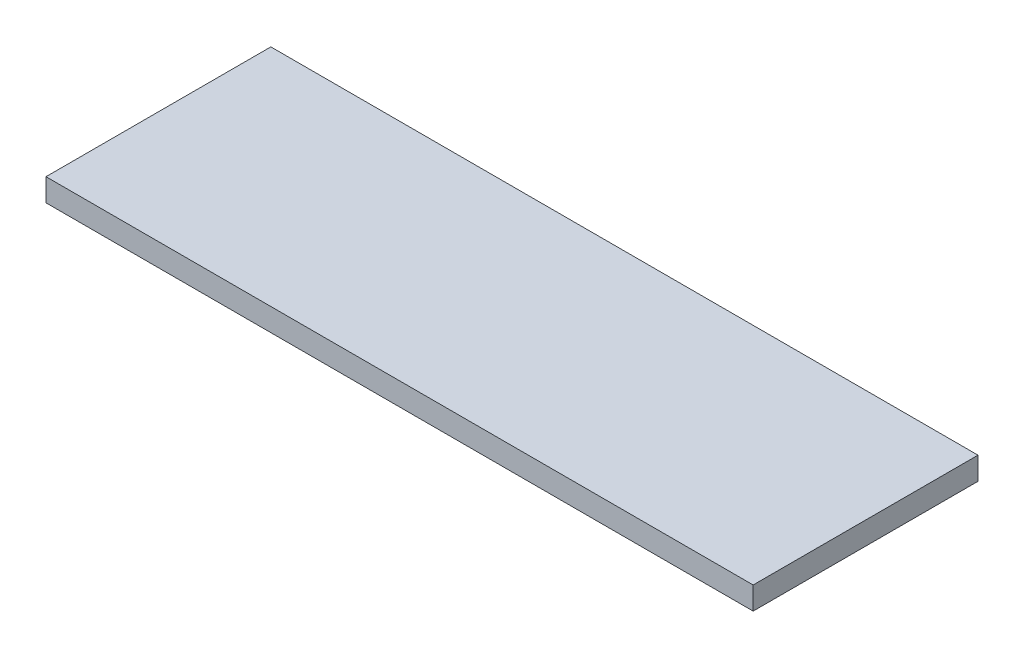
ISO-10303-21;
HEADER;
FILE_DESCRIPTION(('STEP AP214'),'2;1');
FILE_NAME('part.step','',(''),(''),'','','');
FILE_SCHEMA(('AUTOMOTIVE_DESIGN { 1 0 10303 214 1 1 1 1 }'));
ENDSEC;
DATA;
#1=APPLICATION_CONTEXT('core data for automotive mechanical design processes');
#2=APPLICATION_PROTOCOL_DEFINITION('international standard','automotive_design',2000,#1);
#3=PRODUCT_CONTEXT('',#1,'mechanical');
#4=PRODUCT('Part','Part','',(#3));
#5=PRODUCT_RELATED_PRODUCT_CATEGORY('part','',(#4));
#6=PRODUCT_DEFINITION_FORMATION('','',#4);
#7=PRODUCT_DEFINITION_CONTEXT('part definition',#1,'design');
#8=PRODUCT_DEFINITION('design','',#6,#7);
#9=PRODUCT_DEFINITION_SHAPE('','',#8);
#10=(LENGTH_UNIT() NAMED_UNIT(*) SI_UNIT(.MILLI.,.METRE.));
#11=(NAMED_UNIT(*) PLANE_ANGLE_UNIT() SI_UNIT($,.RADIAN.));
#12=(NAMED_UNIT(*) SI_UNIT($,.STERADIAN.) SOLID_ANGLE_UNIT());
#13=UNCERTAINTY_MEASURE_WITH_UNIT(LENGTH_MEASURE(1.E-05),#10,'distance_accuracy_value','');
#14=(GEOMETRIC_REPRESENTATION_CONTEXT(3) GLOBAL_UNCERTAINTY_ASSIGNED_CONTEXT((#13)) GLOBAL_UNIT_ASSIGNED_CONTEXT((#10,
#11,#12)) REPRESENTATION_CONTEXT('',''));
#15=CARTESIAN_POINT('',(0.,0.,0.));
#16=DIRECTION('',(0.,0.,1.));
#17=DIRECTION('',(1.,0.,0.));
#18=AXIS2_PLACEMENT_3D('',#15,#16,#17);
#19=CARTESIAN_POINT('',(99.06,6.35,31.496));
#20=DIRECTION('',(-1.,0.,0.));
#21=DIRECTION('',(0.,0.,1.));
#22=AXIS2_PLACEMENT_3D('',#19,#20,#21);
#23=PLANE('',#22);
#24=DIRECTION('',(0.,0.,-1.));
#25=VECTOR('',#24,1.);
#26=CARTESIAN_POINT('',(99.06,0.,31.496));
#27=LINE('',#26,#25);
#28=CARTESIAN_POINT('',(99.06,0.,31.496));
#29=VERTEX_POINT('',#28);
#30=CARTESIAN_POINT('',(99.06,0.,-31.496));
#31=VERTEX_POINT('',#30);
#32=EDGE_CURVE('E101',#29,#31,#27,.T.);
#33=ORIENTED_EDGE('',*,*,#32,.T.);
#34=DIRECTION('',(0.,-1.,0.));
#35=VECTOR('',#34,1.);
#36=CARTESIAN_POINT('',(99.06,6.35,-31.496));
#37=LINE('',#36,#35);
#38=CARTESIAN_POINT('',(99.06,6.35,-31.496));
#39=VERTEX_POINT('',#38);
#40=EDGE_CURVE('E11',#39,#31,#37,.T.);
#41=ORIENTED_EDGE('',*,*,#40,.F.);
#42=DIRECTION('',(0.,0.,-1.));
#43=VECTOR('',#42,1.);
#44=CARTESIAN_POINT('',(99.06,6.35,31.496));
#45=LINE('',#44,#43);
#46=CARTESIAN_POINT('',(99.06,6.35,31.496));
#47=VERTEX_POINT('',#46);
#48=EDGE_CURVE('E89',#47,#39,#45,.T.);
#49=ORIENTED_EDGE('',*,*,#48,.F.);
#50=DIRECTION('',(0.,-1.,0.));
#51=VECTOR('',#50,1.);
#52=CARTESIAN_POINT('',(99.06,6.35,31.496));
#53=LINE('',#52,#51);
#54=EDGE_CURVE('E97',#47,#29,#53,.T.);
#55=ORIENTED_EDGE('',*,*,#54,.T.);
#56=EDGE_LOOP('',(#33,#41,#49,#55));
#57=FACE_BOUND('',#56,.T.);
#58=ADVANCED_FACE('F38',(#57),#23,.F.);
#59=CARTESIAN_POINT('',(-99.06,6.35,-31.496));
#60=DIRECTION('',(0.,0.,1.));
#61=DIRECTION('',(1.,0.,0.));
#62=AXIS2_PLACEMENT_3D('',#59,#60,#61);
#63=PLANE('',#62);
#64=DIRECTION('',(-1.,0.,0.));
#65=VECTOR('',#64,1.);
#66=CARTESIAN_POINT('',(-99.06,0.,-31.496));
#67=LINE('',#66,#65);
#68=CARTESIAN_POINT('',(-99.06,0.,-31.496));
#69=VERTEX_POINT('',#68);
#70=EDGE_CURVE('E93',#31,#69,#67,.T.);
#71=ORIENTED_EDGE('',*,*,#70,.T.);
#72=DIRECTION('',(0.,-1.,0.));
#73=VECTOR('',#72,1.);
#74=CARTESIAN_POINT('',(-99.06,6.35,-31.496));
#75=LINE('',#74,#73);
#76=CARTESIAN_POINT('',(-99.06,6.35,-31.496));
#77=VERTEX_POINT('',#76);
#78=EDGE_CURVE('E46',#77,#69,#75,.T.);
#79=ORIENTED_EDGE('',*,*,#78,.F.);
#80=DIRECTION('',(-1.,0.,0.));
#81=VECTOR('',#80,1.);
#82=CARTESIAN_POINT('',(-99.06,6.35,-31.496));
#83=LINE('',#82,#81);
#84=EDGE_CURVE('E84',#39,#77,#83,.T.);
#85=ORIENTED_EDGE('',*,*,#84,.F.);
#86=ORIENTED_EDGE('',*,*,#40,.T.);
#87=EDGE_LOOP('',(#71,#79,#85,#86));
#88=FACE_BOUND('',#87,.T.);
#89=ADVANCED_FACE('F92',(#88),#63,.F.);
#90=CARTESIAN_POINT('',(-99.06,6.35,31.496));
#91=DIRECTION('',(1.,0.,0.));
#92=DIRECTION('',(0.,0.,-1.));
#93=AXIS2_PLACEMENT_3D('',#90,#91,#92);
#94=PLANE('',#93);
#95=DIRECTION('',(0.,0.,1.));
#96=VECTOR('',#95,1.);
#97=CARTESIAN_POINT('',(-99.06,0.,31.496));
#98=LINE('',#97,#96);
#99=CARTESIAN_POINT('',(-99.06,0.,31.496));
#100=VERTEX_POINT('',#99);
#101=EDGE_CURVE('E71',#69,#100,#98,.T.);
#102=ORIENTED_EDGE('',*,*,#101,.T.);
#103=DIRECTION('',(0.,-1.,0.));
#104=VECTOR('',#103,1.);
#105=CARTESIAN_POINT('',(-99.06,6.35,31.496));
#106=LINE('',#105,#104);
#107=CARTESIAN_POINT('',(-99.06,6.35,31.496));
#108=VERTEX_POINT('',#107);
#109=EDGE_CURVE('E94',#108,#100,#106,.T.);
#110=ORIENTED_EDGE('',*,*,#109,.F.);
#111=DIRECTION('',(0.,0.,1.));
#112=VECTOR('',#111,1.);
#113=CARTESIAN_POINT('',(-99.06,6.35,31.496));
#114=LINE('',#113,#112);
#115=EDGE_CURVE('E87',#77,#108,#114,.T.);
#116=ORIENTED_EDGE('',*,*,#115,.F.);
#117=ORIENTED_EDGE('',*,*,#78,.T.);
#118=EDGE_LOOP('',(#102,#110,#116,#117));
#119=FACE_BOUND('',#118,.T.);
#120=ADVANCED_FACE('F95',(#119),#94,.F.);
#121=CARTESIAN_POINT('',(-99.06,6.35,31.496));
#122=DIRECTION('',(0.,0.,-1.));
#123=DIRECTION('',(-1.,0.,0.));
#124=AXIS2_PLACEMENT_3D('',#121,#122,#123);
#125=PLANE('',#124);
#126=DIRECTION('',(1.,0.,0.));
#127=VECTOR('',#126,1.);
#128=CARTESIAN_POINT('',(-99.06,0.,31.496));
#129=LINE('',#128,#127);
#130=EDGE_CURVE('E77',#100,#29,#129,.T.);
#131=ORIENTED_EDGE('',*,*,#130,.T.);
#132=ORIENTED_EDGE('',*,*,#54,.F.);
#133=DIRECTION('',(1.,0.,0.));
#134=VECTOR('',#133,1.);
#135=CARTESIAN_POINT('',(-99.06,6.35,31.496));
#136=LINE('',#135,#134);
#137=EDGE_CURVE('E54',#108,#47,#136,.T.);
#138=ORIENTED_EDGE('',*,*,#137,.F.);
#139=ORIENTED_EDGE('',*,*,#109,.T.);
#140=EDGE_LOOP('',(#131,#132,#138,#139));
#141=FACE_BOUND('',#140,.T.);
#142=ADVANCED_FACE('F108',(#141),#125,.F.);
#143=CARTESIAN_POINT('',(0.,6.35,0.));
#144=DIRECTION('',(0.,-1.,0.));
#145=DIRECTION('',(0.,0.,-1.));
#146=AXIS2_PLACEMENT_3D('',#143,#144,#145);
#147=PLANE('',#146);
#148=ORIENTED_EDGE('',*,*,#48,.T.);
#149=ORIENTED_EDGE('',*,*,#84,.T.);
#150=ORIENTED_EDGE('',*,*,#115,.T.);
#151=ORIENTED_EDGE('',*,*,#137,.T.);
#152=EDGE_LOOP('',(#148,#149,#150,#151));
#153=FACE_BOUND('',#152,.T.);
#154=ADVANCED_FACE('F85',(#153),#147,.F.);
#155=CARTESIAN_POINT('',(0.,0.,0.));
#156=DIRECTION('',(0.,-1.,0.));
#157=DIRECTION('',(0.,0.,-1.));
#158=AXIS2_PLACEMENT_3D('',#155,#156,#157);
#159=PLANE('',#158);
#160=ORIENTED_EDGE('',*,*,#32,.F.);
#161=ORIENTED_EDGE('',*,*,#130,.F.);
#162=ORIENTED_EDGE('',*,*,#101,.F.);
#163=ORIENTED_EDGE('',*,*,#70,.F.);
#164=EDGE_LOOP('',(#160,#161,#162,#163));
#165=FACE_BOUND('',#164,.T.);
#166=ADVANCED_FACE('F111',(#165),#159,.T.);
#167=CLOSED_SHELL('',(#58,#89,#120,#142,#154,#166));
#168=MANIFOLD_SOLID_BREP('B2',#167);
#169=ADVANCED_BREP_SHAPE_REPRESENTATION('',(#18,#168),#14);
#170=SHAPE_DEFINITION_REPRESENTATION(#9,#169);
ENDSEC;
END-ISO-10303-21;
